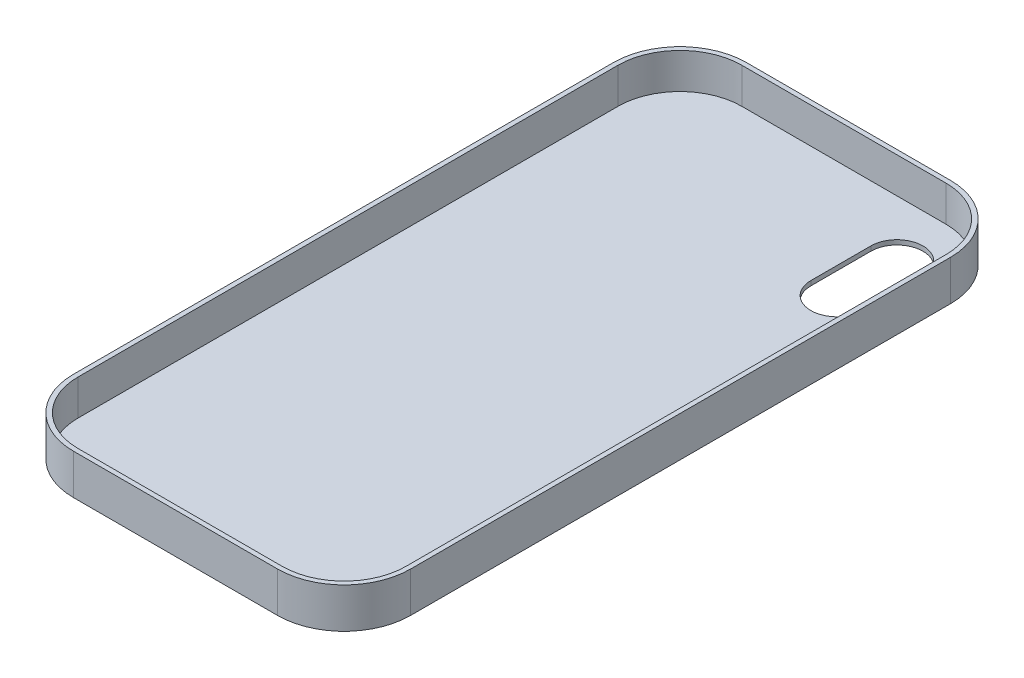
ISO-10303-21;
HEADER;
FILE_DESCRIPTION(('STEP AP214'),'2;1');
FILE_NAME('part.step','',(''),(''),'','','');
FILE_SCHEMA(('AUTOMOTIVE_DESIGN { 1 0 10303 214 1 1 1 1 }'));
ENDSEC;
DATA;
#1=APPLICATION_CONTEXT('core data for automotive mechanical design processes');
#2=APPLICATION_PROTOCOL_DEFINITION('international standard','automotive_design',2000,#1);
#3=PRODUCT_CONTEXT('',#1,'mechanical');
#4=PRODUCT('Part','Part','',(#3));
#5=PRODUCT_RELATED_PRODUCT_CATEGORY('part','',(#4));
#6=PRODUCT_DEFINITION_FORMATION('','',#4);
#7=PRODUCT_DEFINITION_CONTEXT('part definition',#1,'design');
#8=PRODUCT_DEFINITION('design','',#6,#7);
#9=PRODUCT_DEFINITION_SHAPE('','',#8);
#10=(LENGTH_UNIT() NAMED_UNIT(*) SI_UNIT(.MILLI.,.METRE.));
#11=(NAMED_UNIT(*) PLANE_ANGLE_UNIT() SI_UNIT($,.RADIAN.));
#12=(NAMED_UNIT(*) SI_UNIT($,.STERADIAN.) SOLID_ANGLE_UNIT());
#13=UNCERTAINTY_MEASURE_WITH_UNIT(LENGTH_MEASURE(1.E-05),#10,'distance_accuracy_value','');
#14=(GEOMETRIC_REPRESENTATION_CONTEXT(3) GLOBAL_UNCERTAINTY_ASSIGNED_CONTEXT((#13)) GLOBAL_UNIT_ASSIGNED_CONTEXT((#10,
#11,#12)) REPRESENTATION_CONTEXT('',''));
#15=CARTESIAN_POINT('',(0.,0.,0.));
#16=DIRECTION('',(0.,0.,1.));
#17=DIRECTION('',(1.,0.,0.));
#18=AXIS2_PLACEMENT_3D('',#15,#16,#17);
#19=CARTESIAN_POINT('',(22.08,8.7,58.395));
#20=DIRECTION('',(0.,-1.,0.));
#21=DIRECTION('',(0.,0.,-1.));
#22=AXIS2_PLACEMENT_3D('',#19,#20,#21);
#23=CYLINDRICAL_SURFACE('',#22,14.39);
#24=CARTESIAN_POINT('',(22.08,0.,58.395));
#25=DIRECTION('',(0.,1.,0.));
#26=DIRECTION('',(0.,0.,1.));
#27=AXIS2_PLACEMENT_3D('',#24,#25,#26);
#28=CIRCLE('',#27,14.39);
#29=CARTESIAN_POINT('',(22.0799999999999,0.,72.785));
#30=VERTEX_POINT('',#29);
#31=CARTESIAN_POINT('',(36.47,0.,58.3949999999999));
#32=VERTEX_POINT('',#31);
#33=EDGE_CURVE('E254',#30,#32,#28,.T.);
#34=ORIENTED_EDGE('',*,*,#33,.T.);
#35=DIRECTION('',(0.,-1.,0.));
#36=VECTOR('',#35,1.);
#37=CARTESIAN_POINT('',(36.47,8.7,58.3949999999999));
#38=LINE('',#37,#36);
#39=CARTESIAN_POINT('',(36.47,8.7,58.3949999999999));
#40=VERTEX_POINT('',#39);
#41=EDGE_CURVE('E11',#40,#32,#38,.T.);
#42=ORIENTED_EDGE('',*,*,#41,.F.);
#43=CARTESIAN_POINT('',(22.08,8.7,58.395));
#44=DIRECTION('',(0.,1.,0.));
#45=DIRECTION('',(0.,0.,1.));
#46=AXIS2_PLACEMENT_3D('',#43,#44,#45);
#47=CIRCLE('',#46,14.39);
#48=CARTESIAN_POINT('',(22.0799999999999,8.7,72.785));
#49=VERTEX_POINT('',#48);
#50=EDGE_CURVE('E269',#49,#40,#47,.T.);
#51=ORIENTED_EDGE('',*,*,#50,.F.);
#52=DIRECTION('',(0.,-1.,0.));
#53=VECTOR('',#52,1.);
#54=CARTESIAN_POINT('',(22.0799999999999,8.7,72.785));
#55=LINE('',#54,#53);
#56=EDGE_CURVE('E287',#49,#30,#55,.T.);
#57=ORIENTED_EDGE('',*,*,#56,.T.);
#58=EDGE_LOOP('',(#34,#42,#51,#57));
#59=FACE_BOUND('',#58,.T.);
#60=ADVANCED_FACE('F32',(#59),#23,.T.);
#61=CARTESIAN_POINT('',(36.47,8.7,58.3949999999999));
#62=DIRECTION('',(-1.,0.,0.));
#63=DIRECTION('',(0.,0.,1.));
#64=AXIS2_PLACEMENT_3D('',#61,#62,#63);
#65=PLANE('',#64);
#66=DIRECTION('',(0.,0.,-1.));
#67=VECTOR('',#66,1.);
#68=CARTESIAN_POINT('',(36.47,0.,58.3949999999999));
#69=LINE('',#68,#67);
#70=CARTESIAN_POINT('',(36.47,0.,-58.3949999999999));
#71=VERTEX_POINT('',#70);
#72=EDGE_CURVE('E290',#32,#71,#69,.T.);
#73=ORIENTED_EDGE('',*,*,#72,.T.);
#74=DIRECTION('',(0.,-1.,0.));
#75=VECTOR('',#74,1.);
#76=CARTESIAN_POINT('',(36.47,8.7,-58.3949999999999));
#77=LINE('',#76,#75);
#78=CARTESIAN_POINT('',(36.47,8.7,-58.3949999999999));
#79=VERTEX_POINT('',#78);
#80=EDGE_CURVE('E39',#79,#71,#77,.T.);
#81=ORIENTED_EDGE('',*,*,#80,.F.);
#82=DIRECTION('',(0.,0.,-1.));
#83=VECTOR('',#82,1.);
#84=CARTESIAN_POINT('',(36.47,8.7,58.3949999999999));
#85=LINE('',#84,#83);
#86=EDGE_CURVE('E272',#40,#79,#85,.T.);
#87=ORIENTED_EDGE('',*,*,#86,.F.);
#88=ORIENTED_EDGE('',*,*,#41,.T.);
#89=EDGE_LOOP('',(#73,#81,#87,#88));
#90=FACE_BOUND('',#89,.T.);
#91=ADVANCED_FACE('F345',(#90),#65,.F.);
#92=CARTESIAN_POINT('',(22.08,8.7,-58.395));
#93=DIRECTION('',(0.,-1.,0.));
#94=DIRECTION('',(0.,0.,-1.));
#95=AXIS2_PLACEMENT_3D('',#92,#93,#94);
#96=CYLINDRICAL_SURFACE('',#95,14.39);
#97=CARTESIAN_POINT('',(22.08,0.,-58.395));
#98=DIRECTION('',(0.,1.,0.));
#99=DIRECTION('',(0.,0.,-1.));
#100=AXIS2_PLACEMENT_3D('',#97,#98,#99);
#101=CIRCLE('',#100,14.39);
#102=CARTESIAN_POINT('',(22.0799999999999,0.,-72.785));
#103=VERTEX_POINT('',#102);
#104=EDGE_CURVE('E292',#71,#103,#101,.T.);
#105=ORIENTED_EDGE('',*,*,#104,.T.);
#106=DIRECTION('',(0.,-1.,0.));
#107=VECTOR('',#106,1.);
#108=CARTESIAN_POINT('',(22.0799999999999,8.7,-72.785));
#109=LINE('',#108,#107);
#110=CARTESIAN_POINT('',(22.0799999999999,8.7,-72.785));
#111=VERTEX_POINT('',#110);
#112=EDGE_CURVE('E317',#111,#103,#109,.T.);
#113=ORIENTED_EDGE('',*,*,#112,.F.);
#114=CARTESIAN_POINT('',(22.08,8.7,-58.395));
#115=DIRECTION('',(0.,1.,0.));
#116=DIRECTION('',(0.,0.,-1.));
#117=AXIS2_PLACEMENT_3D('',#114,#115,#116);
#118=CIRCLE('',#117,14.39);
#119=EDGE_CURVE('E275',#79,#111,#118,.T.);
#120=ORIENTED_EDGE('',*,*,#119,.F.);
#121=ORIENTED_EDGE('',*,*,#80,.T.);
#122=EDGE_LOOP('',(#105,#113,#120,#121));
#123=FACE_BOUND('',#122,.T.);
#124=ADVANCED_FACE('F324',(#123),#96,.T.);
#125=CARTESIAN_POINT('',(-22.0799999999999,8.7,-72.785));
#126=DIRECTION('',(0.,0.,1.));
#127=DIRECTION('',(1.,0.,0.));
#128=AXIS2_PLACEMENT_3D('',#125,#126,#127);
#129=PLANE('',#128);
#130=DIRECTION('',(-1.,0.,0.));
#131=VECTOR('',#130,1.);
#132=CARTESIAN_POINT('',(-22.0799999999999,0.,-72.785));
#133=LINE('',#132,#131);
#134=CARTESIAN_POINT('',(-22.08,0.,-72.785));
#135=VERTEX_POINT('',#134);
#136=EDGE_CURVE('E294',#103,#135,#133,.T.);
#137=ORIENTED_EDGE('',*,*,#136,.T.);
#138=DIRECTION('',(0.,-1.,0.));
#139=VECTOR('',#138,1.);
#140=CARTESIAN_POINT('',(-22.08,8.7,-72.785));
#141=LINE('',#140,#139);
#142=CARTESIAN_POINT('',(-22.08,8.7,-72.785));
#143=VERTEX_POINT('',#142);
#144=EDGE_CURVE('E314',#143,#135,#141,.T.);
#145=ORIENTED_EDGE('',*,*,#144,.F.);
#146=DIRECTION('',(-1.,0.,0.));
#147=VECTOR('',#146,1.);
#148=CARTESIAN_POINT('',(-22.0799999999999,8.7,-72.785));
#149=LINE('',#148,#147);
#150=EDGE_CURVE('E277',#111,#143,#149,.T.);
#151=ORIENTED_EDGE('',*,*,#150,.F.);
#152=ORIENTED_EDGE('',*,*,#112,.T.);
#153=EDGE_LOOP('',(#137,#145,#151,#152));
#154=FACE_BOUND('',#153,.T.);
#155=ADVANCED_FACE('F333',(#154),#129,.F.);
#156=CARTESIAN_POINT('',(-22.08,8.7,-58.395));
#157=DIRECTION('',(0.,-1.,0.));
#158=DIRECTION('',(0.,0.,-1.));
#159=AXIS2_PLACEMENT_3D('',#156,#157,#158);
#160=CYLINDRICAL_SURFACE('',#159,14.39);
#161=CARTESIAN_POINT('',(-22.08,0.,-58.395));
#162=DIRECTION('',(0.,1.,0.));
#163=DIRECTION('',(0.,0.,-1.));
#164=AXIS2_PLACEMENT_3D('',#161,#162,#163);
#165=CIRCLE('',#164,14.39);
#166=CARTESIAN_POINT('',(-36.47,0.,-58.3949999999999));
#167=VERTEX_POINT('',#166);
#168=EDGE_CURVE('E296',#135,#167,#165,.T.);
#169=ORIENTED_EDGE('',*,*,#168,.T.);
#170=DIRECTION('',(0.,-1.,0.));
#171=VECTOR('',#170,1.);
#172=CARTESIAN_POINT('',(-36.47,8.7,-58.3949999999999));
#173=LINE('',#172,#171);
#174=CARTESIAN_POINT('',(-36.47,8.7,-58.3949999999999));
#175=VERTEX_POINT('',#174);
#176=EDGE_CURVE('E311',#175,#167,#173,.T.);
#177=ORIENTED_EDGE('',*,*,#176,.F.);
#178=CARTESIAN_POINT('',(-22.08,8.7,-58.395));
#179=DIRECTION('',(0.,1.,0.));
#180=DIRECTION('',(0.,0.,-1.));
#181=AXIS2_PLACEMENT_3D('',#178,#179,#180);
#182=CIRCLE('',#181,14.39);
#183=EDGE_CURVE('E279',#143,#175,#182,.T.);
#184=ORIENTED_EDGE('',*,*,#183,.F.);
#185=ORIENTED_EDGE('',*,*,#144,.T.);
#186=EDGE_LOOP('',(#169,#177,#184,#185));
#187=FACE_BOUND('',#186,.T.);
#188=ADVANCED_FACE('F337',(#187),#160,.T.);
#189=CARTESIAN_POINT('',(-36.47,8.7,58.3949999999999));
#190=DIRECTION('',(1.,0.,0.));
#191=DIRECTION('',(0.,0.,-1.));
#192=AXIS2_PLACEMENT_3D('',#189,#190,#191);
#193=PLANE('',#192);
#194=DIRECTION('',(0.,0.,1.));
#195=VECTOR('',#194,1.);
#196=CARTESIAN_POINT('',(-36.47,0.,58.3949999999999));
#197=LINE('',#196,#195);
#198=CARTESIAN_POINT('',(-36.47,0.,58.3949999999999));
#199=VERTEX_POINT('',#198);
#200=EDGE_CURVE('E298',#167,#199,#197,.T.);
#201=ORIENTED_EDGE('',*,*,#200,.T.);
#202=DIRECTION('',(0.,-1.,0.));
#203=VECTOR('',#202,1.);
#204=CARTESIAN_POINT('',(-36.47,8.7,58.3949999999999));
#205=LINE('',#204,#203);
#206=CARTESIAN_POINT('',(-36.47,8.7,58.3949999999999));
#207=VERTEX_POINT('',#206);
#208=EDGE_CURVE('E308',#207,#199,#205,.T.);
#209=ORIENTED_EDGE('',*,*,#208,.F.);
#210=DIRECTION('',(0.,0.,1.));
#211=VECTOR('',#210,1.);
#212=CARTESIAN_POINT('',(-36.47,8.7,58.3949999999999));
#213=LINE('',#212,#211);
#214=EDGE_CURVE('E281',#175,#207,#213,.T.);
#215=ORIENTED_EDGE('',*,*,#214,.F.);
#216=ORIENTED_EDGE('',*,*,#176,.T.);
#217=EDGE_LOOP('',(#201,#209,#215,#216));
#218=FACE_BOUND('',#217,.T.);
#219=ADVANCED_FACE('F358',(#218),#193,.F.);
#220=CARTESIAN_POINT('',(-22.08,8.7,58.395));
#221=DIRECTION('',(0.,-1.,0.));
#222=DIRECTION('',(0.,0.,-1.));
#223=AXIS2_PLACEMENT_3D('',#220,#221,#222);
#224=CYLINDRICAL_SURFACE('',#223,14.39);
#225=CARTESIAN_POINT('',(-22.08,0.,58.395));
#226=DIRECTION('',(0.,1.,0.));
#227=DIRECTION('',(0.,0.,-1.));
#228=AXIS2_PLACEMENT_3D('',#225,#226,#227);
#229=CIRCLE('',#228,14.39);
#230=CARTESIAN_POINT('',(-22.0799999999999,0.,72.785));
#231=VERTEX_POINT('',#230);
#232=EDGE_CURVE('E300',#199,#231,#229,.T.);
#233=ORIENTED_EDGE('',*,*,#232,.T.);
#234=DIRECTION('',(0.,-1.,0.));
#235=VECTOR('',#234,1.);
#236=CARTESIAN_POINT('',(-22.0799999999999,8.7,72.785));
#237=LINE('',#236,#235);
#238=CARTESIAN_POINT('',(-22.0799999999999,8.7,72.785));
#239=VERTEX_POINT('',#238);
#240=EDGE_CURVE('E305',#239,#231,#237,.T.);
#241=ORIENTED_EDGE('',*,*,#240,.F.);
#242=CARTESIAN_POINT('',(-22.08,8.7,58.395));
#243=DIRECTION('',(0.,1.,0.));
#244=DIRECTION('',(0.,0.,-1.));
#245=AXIS2_PLACEMENT_3D('',#242,#243,#244);
#246=CIRCLE('',#245,14.39);
#247=EDGE_CURVE('E283',#207,#239,#246,.T.);
#248=ORIENTED_EDGE('',*,*,#247,.F.);
#249=ORIENTED_EDGE('',*,*,#208,.T.);
#250=EDGE_LOOP('',(#233,#241,#248,#249));
#251=FACE_BOUND('',#250,.T.);
#252=ADVANCED_FACE('F356',(#251),#224,.T.);
#253=CARTESIAN_POINT('',(-22.0799999999999,8.7,72.785));
#254=DIRECTION('',(0.,0.,-1.));
#255=DIRECTION('',(-1.,0.,0.));
#256=AXIS2_PLACEMENT_3D('',#253,#254,#255);
#257=PLANE('',#256);
#258=DIRECTION('',(1.,0.,0.));
#259=VECTOR('',#258,1.);
#260=CARTESIAN_POINT('',(-22.0799999999999,0.,72.785));
#261=LINE('',#260,#259);
#262=EDGE_CURVE('E273',#231,#30,#261,.T.);
#263=ORIENTED_EDGE('',*,*,#262,.T.);
#264=ORIENTED_EDGE('',*,*,#56,.F.);
#265=DIRECTION('',(1.,0.,0.));
#266=VECTOR('',#265,1.);
#267=CARTESIAN_POINT('',(-22.0799999999999,8.7,72.785));
#268=LINE('',#267,#266);
#269=EDGE_CURVE('E285',#239,#49,#268,.T.);
#270=ORIENTED_EDGE('',*,*,#269,.F.);
#271=ORIENTED_EDGE('',*,*,#240,.T.);
#272=EDGE_LOOP('',(#263,#264,#270,#271));
#273=FACE_BOUND('',#272,.T.);
#274=ADVANCED_FACE('F351',(#273),#257,.F.);
#275=CARTESIAN_POINT('',(22.08,8.7,58.395));
#276=DIRECTION('',(0.,1.,0.));
#277=DIRECTION('',(0.,0.,1.));
#278=AXIS2_PLACEMENT_3D('',#275,#276,#277);
#279=PLANE('',#278);
#280=CARTESIAN_POINT('',(22.08,8.7,58.395));
#281=DIRECTION('',(0.,1.,0.));
#282=DIRECTION('',(0.,0.,1.));
#283=AXIS2_PLACEMENT_3D('',#280,#281,#282);
#284=CIRCLE('',#283,13.39);
#285=CARTESIAN_POINT('',(22.0799999999999,8.7,71.785));
#286=VERTEX_POINT('',#285);
#287=CARTESIAN_POINT('',(35.47,8.7,58.395));
#288=VERTEX_POINT('',#287);
#289=EDGE_CURVE('E201',#286,#288,#284,.T.);
#290=ORIENTED_EDGE('',*,*,#289,.F.);
#291=DIRECTION('',(1.,0.,0.));
#292=VECTOR('',#291,1.);
#293=CARTESIAN_POINT('',(-22.0799999999999,8.7,71.785));
#294=LINE('',#293,#292);
#295=CARTESIAN_POINT('',(-22.0799999999999,8.7,71.785));
#296=VERTEX_POINT('',#295);
#297=EDGE_CURVE('E209',#296,#286,#294,.T.);
#298=ORIENTED_EDGE('',*,*,#297,.F.);
#299=CARTESIAN_POINT('',(-22.08,8.7,58.395));
#300=DIRECTION('',(0.,1.,0.));
#301=DIRECTION('',(0.,0.,1.));
#302=AXIS2_PLACEMENT_3D('',#299,#300,#301);
#303=CIRCLE('',#302,13.39);
#304=CARTESIAN_POINT('',(-35.47,8.7,58.3949999999999));
#305=VERTEX_POINT('',#304);
#306=EDGE_CURVE('E247',#305,#296,#303,.T.);
#307=ORIENTED_EDGE('',*,*,#306,.F.);
#308=DIRECTION('',(0.,0.,1.));
#309=VECTOR('',#308,1.);
#310=CARTESIAN_POINT('',(-35.47,8.7,-58.3949999999999));
#311=LINE('',#310,#309);
#312=CARTESIAN_POINT('',(-35.47,8.7,-58.3949999999999));
#313=VERTEX_POINT('',#312);
#314=EDGE_CURVE('E244',#313,#305,#311,.T.);
#315=ORIENTED_EDGE('',*,*,#314,.F.);
#316=CARTESIAN_POINT('',(-22.08,8.7,-58.395));
#317=DIRECTION('',(0.,1.,0.));
#318=DIRECTION('',(0.,0.,1.));
#319=AXIS2_PLACEMENT_3D('',#316,#317,#318);
#320=CIRCLE('',#319,13.39);
#321=CARTESIAN_POINT('',(-22.08,8.7,-71.785));
#322=VERTEX_POINT('',#321);
#323=EDGE_CURVE('E241',#322,#313,#320,.T.);
#324=ORIENTED_EDGE('',*,*,#323,.F.);
#325=DIRECTION('',(-1.,0.,0.));
#326=VECTOR('',#325,1.);
#327=CARTESIAN_POINT('',(22.0799999999999,8.7,-71.785));
#328=LINE('',#327,#326);
#329=CARTESIAN_POINT('',(22.0799999999999,8.7,-71.785));
#330=VERTEX_POINT('',#329);
#331=EDGE_CURVE('E238',#330,#322,#328,.T.);
#332=ORIENTED_EDGE('',*,*,#331,.F.);
#333=CARTESIAN_POINT('',(22.08,8.7,-58.395));
#334=DIRECTION('',(0.,1.,0.));
#335=DIRECTION('',(0.,0.,1.));
#336=AXIS2_PLACEMENT_3D('',#333,#334,#335);
#337=CIRCLE('',#336,13.39);
#338=CARTESIAN_POINT('',(35.47,8.7,-58.3949999999999));
#339=VERTEX_POINT('',#338);
#340=EDGE_CURVE('E235',#339,#330,#337,.T.);
#341=ORIENTED_EDGE('',*,*,#340,.F.);
#342=DIRECTION('',(0.,0.,-1.));
#343=VECTOR('',#342,1.);
#344=CARTESIAN_POINT('',(35.47,8.7,58.395));
#345=LINE('',#344,#343);
#346=EDGE_CURVE('E232',#288,#339,#345,.T.);
#347=ORIENTED_EDGE('',*,*,#346,.F.);
#348=EDGE_LOOP('',(#290,#298,#307,#315,#324,#332,#341,#347));
#349=FACE_BOUND('',#348,.T.);
#350=ORIENTED_EDGE('',*,*,#50,.T.);
#351=ORIENTED_EDGE('',*,*,#86,.T.);
#352=ORIENTED_EDGE('',*,*,#119,.T.);
#353=ORIENTED_EDGE('',*,*,#150,.T.);
#354=ORIENTED_EDGE('',*,*,#183,.T.);
#355=ORIENTED_EDGE('',*,*,#214,.T.);
#356=ORIENTED_EDGE('',*,*,#247,.T.);
#357=ORIENTED_EDGE('',*,*,#269,.T.);
#358=EDGE_LOOP('',(#350,#351,#352,#353,#354,#355,#356,#357));
#359=FACE_BOUND('',#358,.T.);
#360=ADVANCED_FACE('F341',(#349,#359),#279,.T.);
#361=CARTESIAN_POINT('',(22.08,0.,58.395));
#362=DIRECTION('',(0.,1.,0.));
#363=DIRECTION('',(0.,0.,1.));
#364=AXIS2_PLACEMENT_3D('',#361,#362,#363);
#365=PLANE('',#364);
#366=DIRECTION('',(0.,0.,-1.));
#367=VECTOR('',#366,1.);
#368=CARTESIAN_POINT('',(29.28,0.,-59.6));
#369=LINE('',#368,#367);
#370=CARTESIAN_POINT('',(29.28,0.,-46.63));
#371=VERTEX_POINT('',#370);
#372=CARTESIAN_POINT('',(29.28,0.,-59.6));
#373=VERTEX_POINT('',#372);
#374=EDGE_CURVE('E176',#371,#373,#369,.T.);
#375=ORIENTED_EDGE('',*,*,#374,.T.);
#376=CARTESIAN_POINT('',(23.65,0.,-59.6));
#377=DIRECTION('',(0.,1.,0.));
#378=DIRECTION('',(0.,0.,1.));
#379=AXIS2_PLACEMENT_3D('',#376,#377,#378);
#380=CIRCLE('',#379,5.63);
#381=CARTESIAN_POINT('',(18.02,0.,-59.6));
#382=VERTEX_POINT('',#381);
#383=EDGE_CURVE('E170',#373,#382,#380,.T.);
#384=ORIENTED_EDGE('',*,*,#383,.T.);
#385=DIRECTION('',(0.,0.,1.));
#386=VECTOR('',#385,1.);
#387=CARTESIAN_POINT('',(18.02,0.,-59.6));
#388=LINE('',#387,#386);
#389=CARTESIAN_POINT('',(18.02,0.,-46.63));
#390=VERTEX_POINT('',#389);
#391=EDGE_CURVE('E179',#382,#390,#388,.T.);
#392=ORIENTED_EDGE('',*,*,#391,.T.);
#393=CARTESIAN_POINT('',(23.65,0.,-46.63));
#394=DIRECTION('',(0.,1.,0.));
#395=DIRECTION('',(0.,0.,1.));
#396=AXIS2_PLACEMENT_3D('',#393,#394,#395);
#397=CIRCLE('',#396,5.63);
#398=EDGE_CURVE('E46',#390,#371,#397,.T.);
#399=ORIENTED_EDGE('',*,*,#398,.T.);
#400=EDGE_LOOP('',(#375,#384,#392,#399));
#401=FACE_BOUND('',#400,.T.);
#402=ORIENTED_EDGE('',*,*,#33,.F.);
#403=ORIENTED_EDGE('',*,*,#262,.F.);
#404=ORIENTED_EDGE('',*,*,#232,.F.);
#405=ORIENTED_EDGE('',*,*,#200,.F.);
#406=ORIENTED_EDGE('',*,*,#168,.F.);
#407=ORIENTED_EDGE('',*,*,#136,.F.);
#408=ORIENTED_EDGE('',*,*,#104,.F.);
#409=ORIENTED_EDGE('',*,*,#72,.F.);
#410=EDGE_LOOP('',(#402,#403,#404,#405,#406,#407,#408,#409));
#411=FACE_BOUND('',#410,.T.);
#412=ADVANCED_FACE('F183',(#401,#411),#365,.F.);
#413=CARTESIAN_POINT('',(22.08,0.999999999999999,58.395));
#414=DIRECTION('',(0.,1.,0.));
#415=DIRECTION('',(0.,0.,1.));
#416=AXIS2_PLACEMENT_3D('',#413,#414,#415);
#417=CYLINDRICAL_SURFACE('',#416,13.39);
#418=ORIENTED_EDGE('',*,*,#289,.T.);
#419=DIRECTION('',(0.,1.,0.));
#420=VECTOR('',#419,1.);
#421=CARTESIAN_POINT('',(35.47,0.999999999999999,58.395));
#422=LINE('',#421,#420);
#423=CARTESIAN_POINT('',(35.47,0.999999999999999,58.395));
#424=VERTEX_POINT('',#423);
#425=EDGE_CURVE('E230',#424,#288,#422,.T.);
#426=ORIENTED_EDGE('',*,*,#425,.F.);
#427=CARTESIAN_POINT('',(22.08,0.999999999999999,58.395));
#428=DIRECTION('',(0.,1.,0.));
#429=DIRECTION('',(0.,0.,1.));
#430=AXIS2_PLACEMENT_3D('',#427,#428,#429);
#431=CIRCLE('',#430,13.39);
#432=CARTESIAN_POINT('',(22.0799999999999,0.999999999999999,71.785));
#433=VERTEX_POINT('',#432);
#434=EDGE_CURVE('E205',#433,#424,#431,.T.);
#435=ORIENTED_EDGE('',*,*,#434,.F.);
#436=DIRECTION('',(0.,1.,0.));
#437=VECTOR('',#436,1.);
#438=CARTESIAN_POINT('',(22.0799999999999,0.999999999999999,71.785));
#439=LINE('',#438,#437);
#440=EDGE_CURVE('E252',#433,#286,#439,.T.);
#441=ORIENTED_EDGE('',*,*,#440,.T.);
#442=EDGE_LOOP('',(#418,#426,#435,#441));
#443=FACE_BOUND('',#442,.T.);
#444=ADVANCED_FACE('F419',(#443),#417,.F.);
#445=CARTESIAN_POINT('',(-22.0799999999999,0.999999999999999,71.785));
#446=DIRECTION('',(0.,0.,1.));
#447=DIRECTION('',(1.,0.,0.));
#448=AXIS2_PLACEMENT_3D('',#445,#446,#447);
#449=PLANE('',#448);
#450=ORIENTED_EDGE('',*,*,#297,.T.);
#451=ORIENTED_EDGE('',*,*,#440,.F.);
#452=DIRECTION('',(1.,0.,0.));
#453=VECTOR('',#452,1.);
#454=CARTESIAN_POINT('',(-22.0799999999999,0.999999999999999,71.785));
#455=LINE('',#454,#453);
#456=CARTESIAN_POINT('',(-22.0799999999999,0.999999999999999,71.785));
#457=VERTEX_POINT('',#456);
#458=EDGE_CURVE('E227',#457,#433,#455,.T.);
#459=ORIENTED_EDGE('',*,*,#458,.F.);
#460=DIRECTION('',(0.,1.,0.));
#461=VECTOR('',#460,1.);
#462=CARTESIAN_POINT('',(-22.0799999999999,0.999999999999999,71.785));
#463=LINE('',#462,#461);
#464=EDGE_CURVE('E255',#457,#296,#463,.T.);
#465=ORIENTED_EDGE('',*,*,#464,.T.);
#466=EDGE_LOOP('',(#450,#451,#459,#465));
#467=FACE_BOUND('',#466,.T.);
#468=ADVANCED_FACE('F424',(#467),#449,.F.);
#469=CARTESIAN_POINT('',(-22.08,0.999999999999999,58.395));
#470=DIRECTION('',(0.,1.,0.));
#471=DIRECTION('',(0.,0.,1.));
#472=AXIS2_PLACEMENT_3D('',#469,#470,#471);
#473=CYLINDRICAL_SURFACE('',#472,13.39);
#474=ORIENTED_EDGE('',*,*,#306,.T.);
#475=ORIENTED_EDGE('',*,*,#464,.F.);
#476=CARTESIAN_POINT('',(-22.08,0.999999999999999,58.395));
#477=DIRECTION('',(0.,1.,0.));
#478=DIRECTION('',(0.,0.,1.));
#479=AXIS2_PLACEMENT_3D('',#476,#477,#478);
#480=CIRCLE('',#479,13.39);
#481=CARTESIAN_POINT('',(-35.47,0.999999999999999,58.3949999999999));
#482=VERTEX_POINT('',#481);
#483=EDGE_CURVE('E224',#482,#457,#480,.T.);
#484=ORIENTED_EDGE('',*,*,#483,.F.);
#485=DIRECTION('',(0.,1.,0.));
#486=VECTOR('',#485,1.);
#487=CARTESIAN_POINT('',(-35.47,0.999999999999999,58.3949999999999));
#488=LINE('',#487,#486);
#489=EDGE_CURVE('E257',#482,#305,#488,.T.);
#490=ORIENTED_EDGE('',*,*,#489,.T.);
#491=EDGE_LOOP('',(#474,#475,#484,#490));
#492=FACE_BOUND('',#491,.T.);
#493=ADVANCED_FACE('F434',(#492),#473,.F.);
#494=CARTESIAN_POINT('',(-35.47,0.999999999999999,-58.3949999999999));
#495=DIRECTION('',(-1.,0.,0.));
#496=DIRECTION('',(0.,0.,1.));
#497=AXIS2_PLACEMENT_3D('',#494,#495,#496);
#498=PLANE('',#497);
#499=ORIENTED_EDGE('',*,*,#314,.T.);
#500=ORIENTED_EDGE('',*,*,#489,.F.);
#501=DIRECTION('',(0.,0.,1.));
#502=VECTOR('',#501,1.);
#503=CARTESIAN_POINT('',(-35.47,0.999999999999999,-58.3949999999999));
#504=LINE('',#503,#502);
#505=CARTESIAN_POINT('',(-35.47,0.999999999999999,-58.3949999999999));
#506=VERTEX_POINT('',#505);
#507=EDGE_CURVE('E221',#506,#482,#504,.T.);
#508=ORIENTED_EDGE('',*,*,#507,.F.);
#509=DIRECTION('',(0.,1.,0.));
#510=VECTOR('',#509,1.);
#511=CARTESIAN_POINT('',(-35.47,0.999999999999999,-58.3949999999999));
#512=LINE('',#511,#510);
#513=EDGE_CURVE('E259',#506,#313,#512,.T.);
#514=ORIENTED_EDGE('',*,*,#513,.T.);
#515=EDGE_LOOP('',(#499,#500,#508,#514));
#516=FACE_BOUND('',#515,.T.);
#517=ADVANCED_FACE('F444',(#516),#498,.F.);
#518=CARTESIAN_POINT('',(-22.08,0.999999999999999,-58.395));
#519=DIRECTION('',(0.,1.,0.));
#520=DIRECTION('',(0.,0.,1.));
#521=AXIS2_PLACEMENT_3D('',#518,#519,#520);
#522=CYLINDRICAL_SURFACE('',#521,13.39);
#523=ORIENTED_EDGE('',*,*,#323,.T.);
#524=ORIENTED_EDGE('',*,*,#513,.F.);
#525=CARTESIAN_POINT('',(-22.08,0.999999999999999,-58.395));
#526=DIRECTION('',(0.,1.,0.));
#527=DIRECTION('',(0.,0.,1.));
#528=AXIS2_PLACEMENT_3D('',#525,#526,#527);
#529=CIRCLE('',#528,13.39);
#530=CARTESIAN_POINT('',(-22.08,0.999999999999999,-71.785));
#531=VERTEX_POINT('',#530);
#532=EDGE_CURVE('E218',#531,#506,#529,.T.);
#533=ORIENTED_EDGE('',*,*,#532,.F.);
#534=DIRECTION('',(0.,1.,0.));
#535=VECTOR('',#534,1.);
#536=CARTESIAN_POINT('',(-22.08,0.999999999999999,-71.785));
#537=LINE('',#536,#535);
#538=EDGE_CURVE('E261',#531,#322,#537,.T.);
#539=ORIENTED_EDGE('',*,*,#538,.T.);
#540=EDGE_LOOP('',(#523,#524,#533,#539));
#541=FACE_BOUND('',#540,.T.);
#542=ADVANCED_FACE('F454',(#541),#522,.F.);
#543=CARTESIAN_POINT('',(22.0799999999999,0.999999999999999,-71.785));
#544=DIRECTION('',(0.,0.,-1.));
#545=DIRECTION('',(-1.,0.,0.));
#546=AXIS2_PLACEMENT_3D('',#543,#544,#545);
#547=PLANE('',#546);
#548=ORIENTED_EDGE('',*,*,#331,.T.);
#549=ORIENTED_EDGE('',*,*,#538,.F.);
#550=DIRECTION('',(-1.,0.,0.));
#551=VECTOR('',#550,1.);
#552=CARTESIAN_POINT('',(22.0799999999999,0.999999999999999,-71.785));
#553=LINE('',#552,#551);
#554=CARTESIAN_POINT('',(22.0799999999999,0.999999999999999,-71.785));
#555=VERTEX_POINT('',#554);
#556=EDGE_CURVE('E215',#555,#531,#553,.T.);
#557=ORIENTED_EDGE('',*,*,#556,.F.);
#558=DIRECTION('',(0.,1.,0.));
#559=VECTOR('',#558,1.);
#560=CARTESIAN_POINT('',(22.0799999999999,0.999999999999999,-71.785));
#561=LINE('',#560,#559);
#562=EDGE_CURVE('E263',#555,#330,#561,.T.);
#563=ORIENTED_EDGE('',*,*,#562,.T.);
#564=EDGE_LOOP('',(#548,#549,#557,#563));
#565=FACE_BOUND('',#564,.T.);
#566=ADVANCED_FACE('F464',(#565),#547,.F.);
#567=CARTESIAN_POINT('',(22.08,0.999999999999999,-58.395));
#568=DIRECTION('',(0.,1.,0.));
#569=DIRECTION('',(0.,0.,1.));
#570=AXIS2_PLACEMENT_3D('',#567,#568,#569);
#571=CYLINDRICAL_SURFACE('',#570,13.39);
#572=ORIENTED_EDGE('',*,*,#340,.T.);
#573=ORIENTED_EDGE('',*,*,#562,.F.);
#574=CARTESIAN_POINT('',(22.08,0.999999999999999,-58.395));
#575=DIRECTION('',(0.,1.,0.));
#576=DIRECTION('',(0.,0.,1.));
#577=AXIS2_PLACEMENT_3D('',#574,#575,#576);
#578=CIRCLE('',#577,13.39);
#579=CARTESIAN_POINT('',(35.47,0.999999999999999,-58.3949999999999));
#580=VERTEX_POINT('',#579);
#581=EDGE_CURVE('E212',#580,#555,#578,.T.);
#582=ORIENTED_EDGE('',*,*,#581,.F.);
#583=DIRECTION('',(0.,1.,0.));
#584=VECTOR('',#583,1.);
#585=CARTESIAN_POINT('',(35.47,0.999999999999999,-58.3949999999999));
#586=LINE('',#585,#584);
#587=EDGE_CURVE('E265',#580,#339,#586,.T.);
#588=ORIENTED_EDGE('',*,*,#587,.T.);
#589=EDGE_LOOP('',(#572,#573,#582,#588));
#590=FACE_BOUND('',#589,.T.);
#591=ADVANCED_FACE('F474',(#590),#571,.F.);
#592=CARTESIAN_POINT('',(35.47,0.999999999999999,58.395));
#593=DIRECTION('',(1.,0.,0.));
#594=DIRECTION('',(0.,0.,-1.));
#595=AXIS2_PLACEMENT_3D('',#592,#593,#594);
#596=PLANE('',#595);
#597=ORIENTED_EDGE('',*,*,#346,.T.);
#598=ORIENTED_EDGE('',*,*,#587,.F.);
#599=DIRECTION('',(0.,0.,-1.));
#600=VECTOR('',#599,1.);
#601=CARTESIAN_POINT('',(35.47,0.999999999999999,58.395));
#602=LINE('',#601,#600);
#603=EDGE_CURVE('E208',#424,#580,#602,.T.);
#604=ORIENTED_EDGE('',*,*,#603,.F.);
#605=ORIENTED_EDGE('',*,*,#425,.T.);
#606=EDGE_LOOP('',(#597,#598,#604,#605));
#607=FACE_BOUND('',#606,.T.);
#608=ADVANCED_FACE('F484',(#607),#596,.F.);
#609=CARTESIAN_POINT('',(22.08,0.999999999999999,58.395));
#610=DIRECTION('',(0.,1.,0.));
#611=DIRECTION('',(0.,0.,1.));
#612=AXIS2_PLACEMENT_3D('',#609,#610,#611);
#613=PLANE('',#612);
#614=CARTESIAN_POINT('',(23.65,0.999999999999999,-59.6));
#615=DIRECTION('',(0.,1.,0.));
#616=DIRECTION('',(0.,0.,1.));
#617=AXIS2_PLACEMENT_3D('',#614,#615,#616);
#618=CIRCLE('',#617,5.63);
#619=CARTESIAN_POINT('',(29.28,0.999999999999999,-59.6));
#620=VERTEX_POINT('',#619);
#621=CARTESIAN_POINT('',(18.02,0.999999999999999,-59.6));
#622=VERTEX_POINT('',#621);
#623=EDGE_CURVE('E54',#620,#622,#618,.T.);
#624=ORIENTED_EDGE('',*,*,#623,.F.);
#625=DIRECTION('',(0.,0.,-1.));
#626=VECTOR('',#625,1.);
#627=CARTESIAN_POINT('',(29.28,0.999999999999999,-59.6));
#628=LINE('',#627,#626);
#629=CARTESIAN_POINT('',(29.28,0.999999999999999,-46.63));
#630=VERTEX_POINT('',#629);
#631=EDGE_CURVE('E186',#630,#620,#628,.T.);
#632=ORIENTED_EDGE('',*,*,#631,.F.);
#633=CARTESIAN_POINT('',(23.65,0.999999999999999,-46.63));
#634=DIRECTION('',(0.,1.,0.));
#635=DIRECTION('',(0.,0.,1.));
#636=AXIS2_PLACEMENT_3D('',#633,#634,#635);
#637=CIRCLE('',#636,5.63);
#638=CARTESIAN_POINT('',(18.02,0.999999999999999,-46.63));
#639=VERTEX_POINT('',#638);
#640=EDGE_CURVE('E189',#639,#630,#637,.T.);
#641=ORIENTED_EDGE('',*,*,#640,.F.);
#642=DIRECTION('',(0.,0.,1.));
#643=VECTOR('',#642,1.);
#644=CARTESIAN_POINT('',(18.02,0.999999999999999,-59.6));
#645=LINE('',#644,#643);
#646=EDGE_CURVE('E195',#622,#639,#645,.T.);
#647=ORIENTED_EDGE('',*,*,#646,.F.);
#648=EDGE_LOOP('',(#624,#632,#641,#647));
#649=FACE_BOUND('',#648,.T.);
#650=ORIENTED_EDGE('',*,*,#434,.T.);
#651=ORIENTED_EDGE('',*,*,#603,.T.);
#652=ORIENTED_EDGE('',*,*,#581,.T.);
#653=ORIENTED_EDGE('',*,*,#556,.T.);
#654=ORIENTED_EDGE('',*,*,#532,.T.);
#655=ORIENTED_EDGE('',*,*,#507,.T.);
#656=ORIENTED_EDGE('',*,*,#483,.T.);
#657=ORIENTED_EDGE('',*,*,#458,.T.);
#658=EDGE_LOOP('',(#650,#651,#652,#653,#654,#655,#656,#657));
#659=FACE_BOUND('',#658,.T.);
#660=ADVANCED_FACE('F494',(#649,#659),#613,.T.);
#661=CARTESIAN_POINT('',(23.65,0.,-59.6));
#662=DIRECTION('',(0.,1.,0.));
#663=DIRECTION('',(0.,0.,1.));
#664=AXIS2_PLACEMENT_3D('',#661,#662,#663);
#665=CYLINDRICAL_SURFACE('',#664,5.63);
#666=ORIENTED_EDGE('',*,*,#623,.T.);
#667=DIRECTION('',(0.,1.,0.));
#668=VECTOR('',#667,1.);
#669=CARTESIAN_POINT('',(18.02,0.,-59.6));
#670=LINE('',#669,#668);
#671=EDGE_CURVE('E166',#382,#622,#670,.T.);
#672=ORIENTED_EDGE('',*,*,#671,.F.);
#673=ORIENTED_EDGE('',*,*,#383,.F.);
#674=DIRECTION('',(0.,1.,0.));
#675=VECTOR('',#674,1.);
#676=CARTESIAN_POINT('',(29.28,0.,-59.6));
#677=LINE('',#676,#675);
#678=EDGE_CURVE('E199',#373,#620,#677,.T.);
#679=ORIENTED_EDGE('',*,*,#678,.T.);
#680=EDGE_LOOP('',(#666,#672,#673,#679));
#681=FACE_BOUND('',#680,.T.);
#682=ADVANCED_FACE('F168',(#681),#665,.F.);
#683=CARTESIAN_POINT('',(29.28,0.,-59.6));
#684=DIRECTION('',(1.,0.,0.));
#685=DIRECTION('',(0.,0.,-1.));
#686=AXIS2_PLACEMENT_3D('',#683,#684,#685);
#687=PLANE('',#686);
#688=ORIENTED_EDGE('',*,*,#631,.T.);
#689=ORIENTED_EDGE('',*,*,#678,.F.);
#690=ORIENTED_EDGE('',*,*,#374,.F.);
#691=DIRECTION('',(0.,1.,0.));
#692=VECTOR('',#691,1.);
#693=CARTESIAN_POINT('',(29.28,0.,-46.63));
#694=LINE('',#693,#692);
#695=EDGE_CURVE('E202',#371,#630,#694,.T.);
#696=ORIENTED_EDGE('',*,*,#695,.T.);
#697=EDGE_LOOP('',(#688,#689,#690,#696));
#698=FACE_BOUND('',#697,.T.);
#699=ADVANCED_FACE('F519',(#698),#687,.F.);
#700=CARTESIAN_POINT('',(23.65,0.,-46.63));
#701=DIRECTION('',(0.,1.,0.));
#702=DIRECTION('',(0.,0.,1.));
#703=AXIS2_PLACEMENT_3D('',#700,#701,#702);
#704=CYLINDRICAL_SURFACE('',#703,5.63);
#705=ORIENTED_EDGE('',*,*,#640,.T.);
#706=ORIENTED_EDGE('',*,*,#695,.F.);
#707=ORIENTED_EDGE('',*,*,#398,.F.);
#708=DIRECTION('',(0.,1.,0.));
#709=VECTOR('',#708,1.);
#710=CARTESIAN_POINT('',(18.02,0.,-46.63));
#711=LINE('',#710,#709);
#712=EDGE_CURVE('E175',#390,#639,#711,.T.);
#713=ORIENTED_EDGE('',*,*,#712,.T.);
#714=EDGE_LOOP('',(#705,#706,#707,#713));
#715=FACE_BOUND('',#714,.T.);
#716=ADVANCED_FACE('F528',(#715),#704,.F.);
#717=CARTESIAN_POINT('',(18.02,0.,-59.6));
#718=DIRECTION('',(-1.,0.,0.));
#719=DIRECTION('',(0.,0.,1.));
#720=AXIS2_PLACEMENT_3D('',#717,#718,#719);
#721=PLANE('',#720);
#722=ORIENTED_EDGE('',*,*,#646,.T.);
#723=ORIENTED_EDGE('',*,*,#712,.F.);
#724=ORIENTED_EDGE('',*,*,#391,.F.);
#725=ORIENTED_EDGE('',*,*,#671,.T.);
#726=EDGE_LOOP('',(#722,#723,#724,#725));
#727=FACE_BOUND('',#726,.T.);
#728=ADVANCED_FACE('F180',(#727),#721,.F.);
#729=CLOSED_SHELL('',(#60,#91,#124,#155,#188,#219,#252,#274,#360,#412,#444,#468,#493,#517,#542,
#566,#591,#608,#660,#682,#699,#716,#728));
#730=MANIFOLD_SOLID_BREP('B2',#729);
#731=ADVANCED_BREP_SHAPE_REPRESENTATION('',(#18,#730),#14);
#732=SHAPE_DEFINITION_REPRESENTATION(#9,#731);
ENDSEC;
END-ISO-10303-21;
